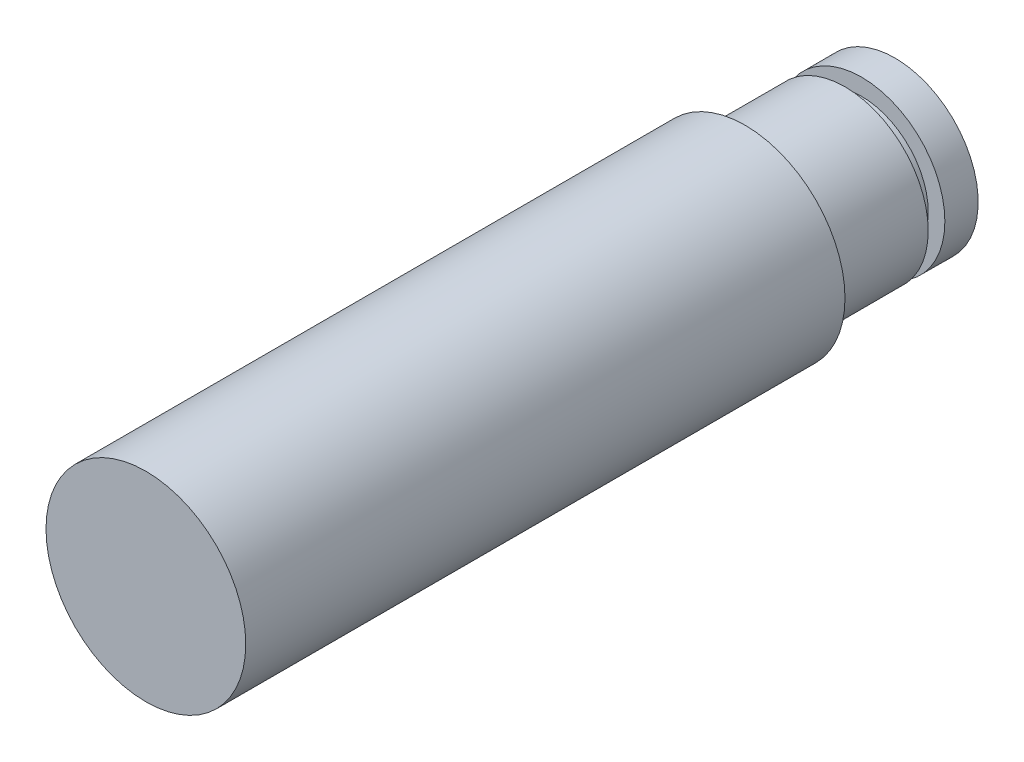
ISO-10303-21;
HEADER;
FILE_DESCRIPTION(('STEP AP214'),'2;1');
FILE_NAME('part.step','',(''),(''),'','','');
FILE_SCHEMA(('AUTOMOTIVE_DESIGN { 1 0 10303 214 1 1 1 1 }'));
ENDSEC;
DATA;
#1=APPLICATION_CONTEXT('core data for automotive mechanical design processes');
#2=APPLICATION_PROTOCOL_DEFINITION('international standard','automotive_design',2000,#1);
#3=PRODUCT_CONTEXT('',#1,'mechanical');
#4=PRODUCT('Part','Part','',(#3));
#5=PRODUCT_RELATED_PRODUCT_CATEGORY('part','',(#4));
#6=PRODUCT_DEFINITION_FORMATION('','',#4);
#7=PRODUCT_DEFINITION_CONTEXT('part definition',#1,'design');
#8=PRODUCT_DEFINITION('design','',#6,#7);
#9=PRODUCT_DEFINITION_SHAPE('','',#8);
#10=(LENGTH_UNIT() NAMED_UNIT(*) SI_UNIT(.MILLI.,.METRE.));
#11=(NAMED_UNIT(*) PLANE_ANGLE_UNIT() SI_UNIT($,.RADIAN.));
#12=(NAMED_UNIT(*) SI_UNIT($,.STERADIAN.) SOLID_ANGLE_UNIT());
#13=UNCERTAINTY_MEASURE_WITH_UNIT(LENGTH_MEASURE(1.E-05),#10,'distance_accuracy_value','');
#14=(GEOMETRIC_REPRESENTATION_CONTEXT(3) GLOBAL_UNCERTAINTY_ASSIGNED_CONTEXT((#13)) GLOBAL_UNIT_ASSIGNED_CONTEXT((#10,
#11,#12)) REPRESENTATION_CONTEXT('',''));
#15=CARTESIAN_POINT('',(0.,0.,0.));
#16=DIRECTION('',(0.,0.,1.));
#17=DIRECTION('',(1.,0.,0.));
#18=AXIS2_PLACEMENT_3D('',#15,#16,#17);
#19=CARTESIAN_POINT('',(0.,0.,18.));
#20=DIRECTION('',(0.,0.,-1.));
#21=DIRECTION('',(-1.,0.,0.));
#22=AXIS2_PLACEMENT_3D('',#19,#20,#21);
#23=CYLINDRICAL_SURFACE('',#22,10.);
#24=CARTESIAN_POINT('',(0.,0.,18.));
#25=DIRECTION('',(0.,0.,-1.));
#26=DIRECTION('',(-1.,0.,0.));
#27=AXIS2_PLACEMENT_3D('',#24,#25,#26);
#28=CIRCLE('',#27,10.);
#29=CARTESIAN_POINT('',(-10.,0.,18.));
#30=VERTEX_POINT('',#29);
#31=EDGE_CURVE('E43',#30,#30,#28,.T.);
#32=ORIENTED_EDGE('',*,*,#31,.T.);
#33=EDGE_LOOP('',(#32));
#34=FACE_BOUND('',#33,.T.);
#35=CARTESIAN_POINT('',(0.,0.,6.));
#36=DIRECTION('',(0.,0.,1.));
#37=DIRECTION('',(1.,0.,0.));
#38=AXIS2_PLACEMENT_3D('',#35,#36,#37);
#39=CIRCLE('',#38,10.);
#40=CARTESIAN_POINT('',(10.,0.,6.));
#41=VERTEX_POINT('',#40);
#42=EDGE_CURVE('E61',#41,#41,#39,.T.);
#43=ORIENTED_EDGE('',*,*,#42,.T.);
#44=EDGE_LOOP('',(#43));
#45=FACE_BOUND('',#44,.T.);
#46=ADVANCED_FACE('F32',(#34,#45),#23,.T.);
#47=CARTESIAN_POINT('',(0.,0.,90.));
#48=DIRECTION('',(0.,0.,-1.));
#49=DIRECTION('',(-1.,0.,0.));
#50=AXIS2_PLACEMENT_3D('',#47,#48,#49);
#51=CYLINDRICAL_SURFACE('',#50,12.);
#52=CARTESIAN_POINT('',(0.,0.,90.));
#53=DIRECTION('',(0.,0.,1.));
#54=DIRECTION('',(1.,0.,0.));
#55=AXIS2_PLACEMENT_3D('',#52,#53,#54);
#56=CIRCLE('',#55,12.);
#57=CARTESIAN_POINT('',(12.,0.,90.));
#58=VERTEX_POINT('',#57);
#59=EDGE_CURVE('E10',#58,#58,#56,.T.);
#60=ORIENTED_EDGE('',*,*,#59,.F.);
#61=EDGE_LOOP('',(#60));
#62=FACE_BOUND('',#61,.T.);
#63=CARTESIAN_POINT('',(0.,0.,18.));
#64=DIRECTION('',(0.,0.,-1.));
#65=DIRECTION('',(-1.,0.,0.));
#66=AXIS2_PLACEMENT_3D('',#63,#64,#65);
#67=CIRCLE('',#66,12.);
#68=CARTESIAN_POINT('',(-12.,0.,18.));
#69=VERTEX_POINT('',#68);
#70=EDGE_CURVE('E39',#69,#69,#67,.T.);
#71=ORIENTED_EDGE('',*,*,#70,.F.);
#72=EDGE_LOOP('',(#71));
#73=FACE_BOUND('',#72,.T.);
#74=ADVANCED_FACE('F34',(#62,#73),#51,.T.);
#75=CARTESIAN_POINT('',(0.,0.,90.));
#76=DIRECTION('',(0.,0.,1.));
#77=DIRECTION('',(1.,0.,0.));
#78=AXIS2_PLACEMENT_3D('',#75,#76,#77);
#79=PLANE('',#78);
#80=ORIENTED_EDGE('',*,*,#59,.T.);
#81=EDGE_LOOP('',(#80));
#82=FACE_BOUND('',#81,.T.);
#83=ADVANCED_FACE('F79',(#82),#79,.T.);
#84=CARTESIAN_POINT('',(0.,0.,18.));
#85=DIRECTION('',(0.,0.,-1.));
#86=DIRECTION('',(-1.,0.,0.));
#87=AXIS2_PLACEMENT_3D('',#84,#85,#86);
#88=PLANE('',#87);
#89=ORIENTED_EDGE('',*,*,#31,.F.);
#90=EDGE_LOOP('',(#89));
#91=FACE_BOUND('',#90,.T.);
#92=ORIENTED_EDGE('',*,*,#70,.T.);
#93=EDGE_LOOP('',(#92));
#94=FACE_BOUND('',#93,.T.);
#95=ADVANCED_FACE('F69',(#91,#94),#88,.T.);
#96=CARTESIAN_POINT('',(0.,10.,6.));
#97=DIRECTION('',(0.,0.,-1.));
#98=DIRECTION('',(-1.,0.,0.));
#99=AXIS2_PLACEMENT_3D('',#96,#97,#98);
#100=PLANE('',#99);
#101=CARTESIAN_POINT('',(0.,0.,6.));
#102=DIRECTION('',(0.,0.,1.));
#103=DIRECTION('',(1.,0.,0.));
#104=AXIS2_PLACEMENT_3D('',#101,#102,#103);
#105=CIRCLE('',#104,8.);
#106=CARTESIAN_POINT('',(8.,0.,6.));
#107=VERTEX_POINT('',#106);
#108=EDGE_CURVE('E51',#107,#107,#105,.T.);
#109=ORIENTED_EDGE('',*,*,#108,.T.);
#110=EDGE_LOOP('',(#109));
#111=FACE_BOUND('',#110,.T.);
#112=ORIENTED_EDGE('',*,*,#42,.F.);
#113=EDGE_LOOP('',(#112));
#114=FACE_BOUND('',#113,.T.);
#115=ADVANCED_FACE('F66',(#111,#114),#100,.T.);
#116=CARTESIAN_POINT('',(0.,0.,18.));
#117=DIRECTION('',(0.,0.,1.));
#118=DIRECTION('',(1.,0.,0.));
#119=AXIS2_PLACEMENT_3D('',#116,#117,#118);
#120=CYLINDRICAL_SURFACE('',#119,8.);
#121=CARTESIAN_POINT('',(0.,0.,4.));
#122=DIRECTION('',(0.,0.,1.));
#123=DIRECTION('',(1.,0.,0.));
#124=AXIS2_PLACEMENT_3D('',#121,#122,#123);
#125=CIRCLE('',#124,8.);
#126=CARTESIAN_POINT('',(8.,0.,4.));
#127=VERTEX_POINT('',#126);
#128=EDGE_CURVE('E55',#127,#127,#125,.T.);
#129=ORIENTED_EDGE('',*,*,#128,.T.);
#130=EDGE_LOOP('',(#129));
#131=FACE_BOUND('',#130,.T.);
#132=ORIENTED_EDGE('',*,*,#108,.F.);
#133=EDGE_LOOP('',(#132));
#134=FACE_BOUND('',#133,.T.);
#135=ADVANCED_FACE('F68',(#131,#134),#120,.T.);
#136=CARTESIAN_POINT('',(0.,10.,4.));
#137=DIRECTION('',(0.,0.,-1.));
#138=DIRECTION('',(-1.,0.,0.));
#139=AXIS2_PLACEMENT_3D('',#136,#137,#138);
#140=PLANE('',#139);
#141=ORIENTED_EDGE('',*,*,#128,.F.);
#142=EDGE_LOOP('',(#141));
#143=FACE_BOUND('',#142,.T.);
#144=CARTESIAN_POINT('',(0.,0.,4.));
#145=DIRECTION('',(0.,0.,1.));
#146=DIRECTION('',(1.,0.,0.));
#147=AXIS2_PLACEMENT_3D('',#144,#145,#146);
#148=CIRCLE('',#147,10.);
#149=CARTESIAN_POINT('',(10.,0.,4.));
#150=VERTEX_POINT('',#149);
#151=EDGE_CURVE('E58',#150,#150,#148,.T.);
#152=ORIENTED_EDGE('',*,*,#151,.T.);
#153=EDGE_LOOP('',(#152));
#154=FACE_BOUND('',#153,.T.);
#155=ADVANCED_FACE('F76',(#143,#154),#140,.F.);
#156=CARTESIAN_POINT('',(0.,0.,0.));
#157=DIRECTION('',(0.,0.,1.));
#158=DIRECTION('',(1.,0.,0.));
#159=AXIS2_PLACEMENT_3D('',#156,#157,#158);
#160=PLANE('',#159);
#161=CARTESIAN_POINT('',(0.,0.,0.));
#162=DIRECTION('',(0.,0.,-1.));
#163=DIRECTION('',(-1.,0.,0.));
#164=AXIS2_PLACEMENT_3D('',#161,#162,#163);
#165=CIRCLE('',#164,10.);
#166=CARTESIAN_POINT('',(-10.,0.,0.));
#167=VERTEX_POINT('',#166);
#168=EDGE_CURVE('E47',#167,#167,#165,.T.);
#169=ORIENTED_EDGE('',*,*,#168,.T.);
#170=EDGE_LOOP('',(#169));
#171=FACE_BOUND('',#170,.T.);
#172=ADVANCED_FACE('F91',(#171),#160,.F.);
#173=ORIENTED_EDGE('',*,*,#151,.F.);
#174=EDGE_LOOP('',(#173));
#175=FACE_BOUND('',#174,.T.);
#176=ORIENTED_EDGE('',*,*,#168,.F.);
#177=EDGE_LOOP('',(#176));
#178=FACE_BOUND('',#177,.T.);
#179=ADVANCED_FACE('F85',(#175,#178),#23,.T.);
#180=CLOSED_SHELL('',(#46,#74,#83,#95,#115,#135,#155,#172,#179));
#181=MANIFOLD_SOLID_BREP('B2',#180);
#182=ADVANCED_BREP_SHAPE_REPRESENTATION('',(#18,#181),#14);
#183=SHAPE_DEFINITION_REPRESENTATION(#9,#182);
ENDSEC;
END-ISO-10303-21;
